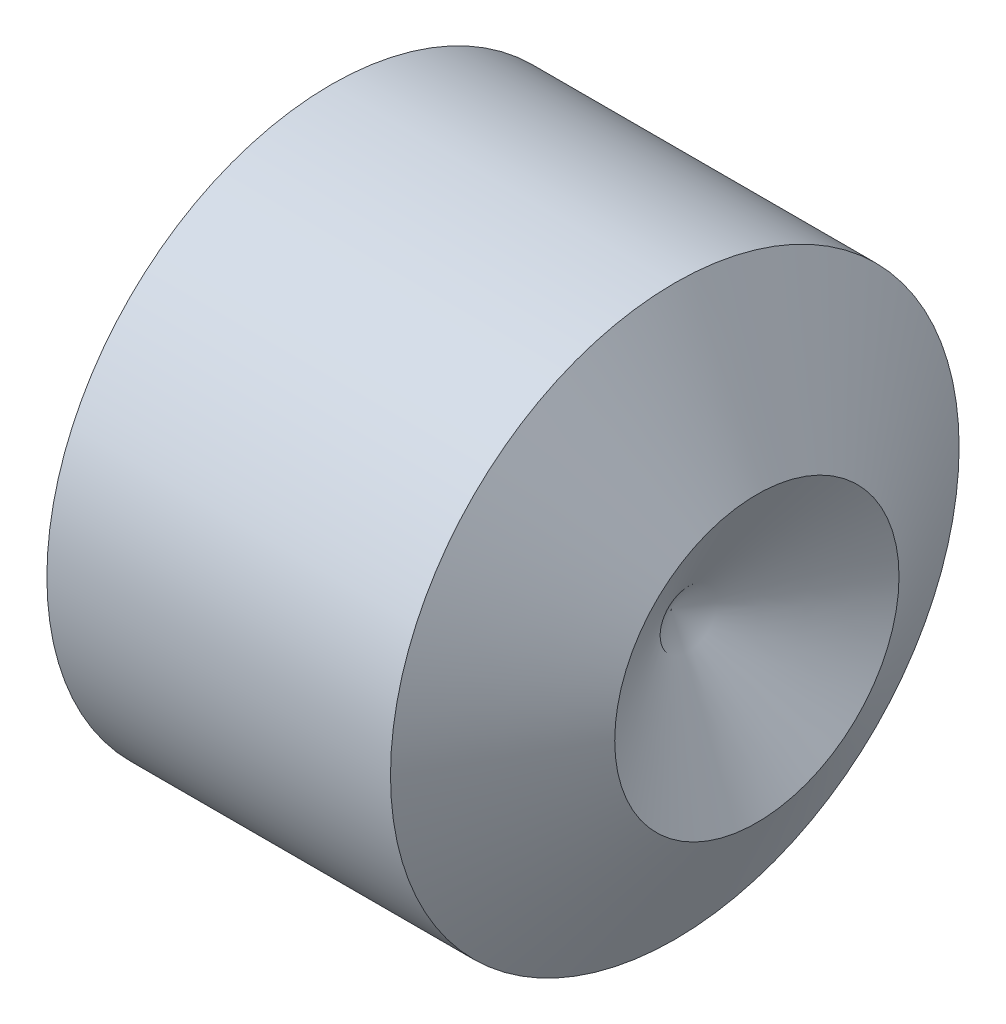
ISO-10303-21;
HEADER;
FILE_DESCRIPTION(('STEP AP214'),'2;1');
FILE_NAME('part.step','',(''),(''),'','','');
FILE_SCHEMA(('AUTOMOTIVE_DESIGN { 1 0 10303 214 1 1 1 1 }'));
ENDSEC;
DATA;
#1=APPLICATION_CONTEXT('core data for automotive mechanical design processes');
#2=APPLICATION_PROTOCOL_DEFINITION('international standard','automotive_design',2000,#1);
#3=PRODUCT_CONTEXT('',#1,'mechanical');
#4=PRODUCT('Part','Part','',(#3));
#5=PRODUCT_RELATED_PRODUCT_CATEGORY('part','',(#4));
#6=PRODUCT_DEFINITION_FORMATION('','',#4);
#7=PRODUCT_DEFINITION_CONTEXT('part definition',#1,'design');
#8=PRODUCT_DEFINITION('design','',#6,#7);
#9=PRODUCT_DEFINITION_SHAPE('','',#8);
#10=(LENGTH_UNIT() NAMED_UNIT(*) SI_UNIT(.MILLI.,.METRE.));
#11=(NAMED_UNIT(*) PLANE_ANGLE_UNIT() SI_UNIT($,.RADIAN.));
#12=(NAMED_UNIT(*) SI_UNIT($,.STERADIAN.) SOLID_ANGLE_UNIT());
#13=UNCERTAINTY_MEASURE_WITH_UNIT(LENGTH_MEASURE(1.E-05),#10,'distance_accuracy_value','');
#14=(GEOMETRIC_REPRESENTATION_CONTEXT(3) GLOBAL_UNCERTAINTY_ASSIGNED_CONTEXT((#13)) GLOBAL_UNIT_ASSIGNED_CONTEXT((#10,
#11,#12)) REPRESENTATION_CONTEXT('',''));
#15=CARTESIAN_POINT('',(0.,0.,0.));
#16=DIRECTION('',(0.,0.,1.));
#17=DIRECTION('',(1.,0.,0.));
#18=AXIS2_PLACEMENT_3D('',#15,#16,#17);
#19=CARTESIAN_POINT('',(-23.7448501262202,0.0231396517733629,4.59881748088264));
#20=DIRECTION('',(-1.,0.,0.));
#21=DIRECTION('',(0.,0.,1.));
#22=AXIS2_PLACEMENT_3D('',#19,#20,#21);
#23=PLANE('',#22);
#24=CARTESIAN_POINT('',(-23.7448501262202,0.0231396517733629,4.59881748088264));
#25=DIRECTION('',(-1.,0.,0.));
#26=DIRECTION('',(0.,0.,1.));
#27=AXIS2_PLACEMENT_3D('',#24,#25,#26);
#28=CIRCLE('',#27,2.055);
#29=CARTESIAN_POINT('',(-23.7448501262202,0.0231396517733629,6.65381748088265));
#30=VERTEX_POINT('',#29);
#31=EDGE_CURVE('E10',#30,#30,#28,.T.);
#32=ORIENTED_EDGE('',*,*,#31,.T.);
#33=EDGE_LOOP('',(#32));
#34=FACE_BOUND('',#33,.T.);
#35=DIRECTION('',(0.,0.,-1.));
#36=VECTOR('',#35,1.);
#37=CARTESIAN_POINT('',(-23.7448501262202,1.27313965177336,5.32050531736968));
#38=LINE('',#37,#36);
#39=CARTESIAN_POINT('',(-23.7448501262202,1.27313965177336,5.32050531736968));
#40=VERTEX_POINT('',#39);
#41=CARTESIAN_POINT('',(-23.7448501262202,1.27313965177336,3.87712964439561));
#42=VERTEX_POINT('',#41);
#43=EDGE_CURVE('E77',#40,#42,#38,.T.);
#44=ORIENTED_EDGE('',*,*,#43,.F.);
#45=DIRECTION('',(0.,-0.866025403784438,0.5));
#46=VECTOR('',#45,1.);
#47=CARTESIAN_POINT('',(-23.7448501262202,1.27313965177336,5.32050531736968));
#48=LINE('',#47,#46);
#49=CARTESIAN_POINT('',(-23.7448501262202,0.0231396517733635,6.04219315385671));
#50=VERTEX_POINT('',#49);
#51=EDGE_CURVE('E30',#40,#50,#48,.T.);
#52=ORIENTED_EDGE('',*,*,#51,.T.);
#53=DIRECTION('',(0.,0.866025403784439,0.5));
#54=VECTOR('',#53,1.);
#55=CARTESIAN_POINT('',(-23.7448501262202,-1.22686034822664,5.32050531736968));
#56=LINE('',#55,#54);
#57=CARTESIAN_POINT('',(-23.7448501262202,-1.22686034822664,5.32050531736968));
#58=VERTEX_POINT('',#57);
#59=EDGE_CURVE('E83',#58,#50,#56,.T.);
#60=ORIENTED_EDGE('',*,*,#59,.F.);
#61=DIRECTION('',(0.,0.,-1.));
#62=VECTOR('',#61,1.);
#63=CARTESIAN_POINT('',(-23.7448501262202,-1.22686034822664,5.32050531736968));
#64=LINE('',#63,#62);
#65=CARTESIAN_POINT('',(-23.7448501262202,-1.22686034822664,3.87712964439561));
#66=VERTEX_POINT('',#65);
#67=EDGE_CURVE('E103',#58,#66,#64,.T.);
#68=ORIENTED_EDGE('',*,*,#67,.T.);
#69=DIRECTION('',(0.,0.866025403784438,-0.500000000000001));
#70=VECTOR('',#69,1.);
#71=CARTESIAN_POINT('',(-23.7448501262202,-1.22686034822664,3.87712964439561));
#72=LINE('',#71,#70);
#73=CARTESIAN_POINT('',(-23.7448501262202,0.0231396517733629,3.15544180790858));
#74=VERTEX_POINT('',#73);
#75=EDGE_CURVE('E106',#66,#74,#72,.T.);
#76=ORIENTED_EDGE('',*,*,#75,.T.);
#77=DIRECTION('',(0.,-0.866025403784439,-0.5));
#78=VECTOR('',#77,1.);
#79=CARTESIAN_POINT('',(-23.7448501262202,1.27313965177336,3.87712964439561));
#80=LINE('',#79,#78);
#81=EDGE_CURVE('E109',#42,#74,#80,.T.);
#82=ORIENTED_EDGE('',*,*,#81,.F.);
#83=EDGE_LOOP('',(#44,#52,#60,#68,#76,#82));
#84=FACE_BOUND('',#83,.T.);
#85=ADVANCED_FACE('F16',(#34,#84),#23,.T.);
#86=CARTESIAN_POINT('',(-23.7448501262202,0.0231396517733629,4.59881748088264));
#87=DIRECTION('',(1.,0.,0.));
#88=DIRECTION('',(0.,0.,-1.));
#89=AXIS2_PLACEMENT_3D('',#86,#87,#88);
#90=CONICAL_SURFACE('',#89,2.055,1.0471975511966);
#91=CARTESIAN_POINT('',(-23.4879292564308,0.0231396517733629,4.59881748088264));
#92=DIRECTION('',(-1.,0.,0.));
#93=DIRECTION('',(0.,0.,1.));
#94=AXIS2_PLACEMENT_3D('',#91,#92,#93);
#95=CIRCLE('',#94,2.5);
#96=CARTESIAN_POINT('',(-23.4879292564308,0.0231396517733629,7.09881748088265));
#97=VERTEX_POINT('',#96);
#98=EDGE_CURVE('E23',#97,#97,#95,.T.);
#99=ORIENTED_EDGE('',*,*,#98,.T.);
#100=EDGE_LOOP('',(#99));
#101=FACE_BOUND('',#100,.T.);
#102=ORIENTED_EDGE('',*,*,#31,.F.);
#103=EDGE_LOOP('',(#102));
#104=FACE_BOUND('',#103,.T.);
#105=ADVANCED_FACE('F129',(#101,#104),#90,.T.);
#106=CARTESIAN_POINT('',(-36.4448501262202,0.0231396517733629,4.59881748088264));
#107=DIRECTION('',(-1.,0.,0.));
#108=DIRECTION('',(0.,0.,1.));
#109=AXIS2_PLACEMENT_3D('',#106,#107,#108);
#110=CYLINDRICAL_SURFACE('',#109,2.5);
#111=CARTESIAN_POINT('',(-20.4665379627072,0.0231396517733629,4.59881748088264));
#112=DIRECTION('',(-1.,0.,0.));
#113=DIRECTION('',(0.,0.,1.));
#114=AXIS2_PLACEMENT_3D('',#111,#112,#113);
#115=CIRCLE('',#114,2.5);
#116=CARTESIAN_POINT('',(-20.4665379627072,0.0231396517733629,7.09881748088265));
#117=VERTEX_POINT('',#116);
#118=EDGE_CURVE('E124',#117,#117,#115,.T.);
#119=ORIENTED_EDGE('',*,*,#118,.T.);
#120=EDGE_LOOP('',(#119));
#121=FACE_BOUND('',#120,.T.);
#122=ORIENTED_EDGE('',*,*,#98,.F.);
#123=EDGE_LOOP('',(#122));
#124=FACE_BOUND('',#123,.T.);
#125=ADVANCED_FACE('F132',(#121,#124),#110,.T.);
#126=CARTESIAN_POINT('',(-20.4665379627072,0.0231396517733629,4.59881748088264));
#127=DIRECTION('',(-1.,0.,0.));
#128=DIRECTION('',(0.,0.,1.));
#129=AXIS2_PLACEMENT_3D('',#126,#127,#128);
#130=CONICAL_SURFACE('',#129,2.5,1.0471975511966);
#131=CARTESIAN_POINT('',(-19.7448501262202,0.0231396517733629,4.59881748088264));
#132=DIRECTION('',(-1.,0.,0.));
#133=DIRECTION('',(0.,0.,1.));
#134=AXIS2_PLACEMENT_3D('',#131,#132,#133);
#135=CIRCLE('',#134,1.25);
#136=CARTESIAN_POINT('',(-19.7448501262202,0.0231396517733629,5.84881748088264));
#137=VERTEX_POINT('',#136);
#138=EDGE_CURVE('E84',#137,#137,#135,.T.);
#139=ORIENTED_EDGE('',*,*,#138,.T.);
#140=EDGE_LOOP('',(#139));
#141=FACE_BOUND('',#140,.T.);
#142=ORIENTED_EDGE('',*,*,#118,.F.);
#143=EDGE_LOOP('',(#142));
#144=FACE_BOUND('',#143,.T.);
#145=ADVANCED_FACE('F134',(#141,#144),#130,.T.);
#146=CARTESIAN_POINT('',(-20.4959259000046,0.0231396517733629,4.59881748088264));
#147=DIRECTION('',(1.,0.,0.));
#148=DIRECTION('',(0.,0.,-1.));
#149=AXIS2_PLACEMENT_3D('',#146,#147,#148);
#150=CONICAL_SURFACE('',#149,0.,1.02974425867666);
#151=ORIENTED_EDGE('',*,*,#138,.F.);
#152=EDGE_LOOP('',(#151));
#153=FACE_BOUND('',#152,.T.);
#154=CARTESIAN_POINT('',(-20.4959259000046,0.0231396517733629,4.59881748088264));
#155=VERTEX_POINT('',#154);
#156=VERTEX_LOOP('',#155);
#157=FACE_BOUND('',#156,.T.);
#158=ADVANCED_FACE('F142',(#153,#157),#150,.F.);
#159=CARTESIAN_POINT('',(-21.7448501262202,1.27313965177336,5.32050531736968));
#160=DIRECTION('',(0.,-0.5,-0.866025403784438));
#161=DIRECTION('',(0.,0.866025403784438,-0.5));
#162=AXIS2_PLACEMENT_3D('',#159,#160,#161);
#163=PLANE('',#162);
#164=ORIENTED_EDGE('',*,*,#51,.F.);
#165=DIRECTION('',(-1.,0.,0.));
#166=VECTOR('',#165,1.);
#167=CARTESIAN_POINT('',(-21.7448501262202,1.27313965177336,5.32050531736968));
#168=LINE('',#167,#166);
#169=CARTESIAN_POINT('',(-21.7448501262202,1.27313965177336,5.32050531736968));
#170=VERTEX_POINT('',#169);
#171=EDGE_CURVE('E71',#170,#40,#168,.T.);
#172=ORIENTED_EDGE('',*,*,#171,.F.);
#173=DIRECTION('',(0.,-0.866025403784438,0.5));
#174=VECTOR('',#173,1.);
#175=CARTESIAN_POINT('',(-21.7448501262202,1.27313965177336,5.32050531736968));
#176=LINE('',#175,#174);
#177=CARTESIAN_POINT('',(-21.7448501262202,0.0231396517733635,6.04219315385671));
#178=VERTEX_POINT('',#177);
#179=EDGE_CURVE('E66',#170,#178,#176,.T.);
#180=ORIENTED_EDGE('',*,*,#179,.T.);
#181=DIRECTION('',(-1.,0.,0.));
#182=VECTOR('',#181,1.);
#183=CARTESIAN_POINT('',(-21.7448501262202,0.0231396517733635,6.04219315385671));
#184=LINE('',#183,#182);
#185=EDGE_CURVE('E69',#178,#50,#184,.T.);
#186=ORIENTED_EDGE('',*,*,#185,.T.);
#187=EDGE_LOOP('',(#164,#172,#180,#186));
#188=FACE_BOUND('',#187,.T.);
#189=ADVANCED_FACE('F68',(#188),#163,.T.);
#190=CARTESIAN_POINT('',(-21.7448501262202,-1.22686034822664,5.32050531736968));
#191=DIRECTION('',(0.,-0.5,0.866025403784439));
#192=DIRECTION('',(0.,-0.866025403784439,-0.5));
#193=AXIS2_PLACEMENT_3D('',#190,#191,#192);
#194=PLANE('',#193);
#195=ORIENTED_EDGE('',*,*,#59,.T.);
#196=ORIENTED_EDGE('',*,*,#185,.F.);
#197=DIRECTION('',(0.,0.866025403784439,0.5));
#198=VECTOR('',#197,1.);
#199=CARTESIAN_POINT('',(-21.7448501262202,-1.22686034822664,5.32050531736968));
#200=LINE('',#199,#198);
#201=CARTESIAN_POINT('',(-21.7448501262202,-1.22686034822664,5.32050531736968));
#202=VERTEX_POINT('',#201);
#203=EDGE_CURVE('E76',#202,#178,#200,.T.);
#204=ORIENTED_EDGE('',*,*,#203,.F.);
#205=DIRECTION('',(-1.,0.,0.));
#206=VECTOR('',#205,1.);
#207=CARTESIAN_POINT('',(-21.7448501262202,-1.22686034822664,5.32050531736968));
#208=LINE('',#207,#206);
#209=EDGE_CURVE('E85',#202,#58,#208,.T.);
#210=ORIENTED_EDGE('',*,*,#209,.T.);
#211=EDGE_LOOP('',(#195,#196,#204,#210));
#212=FACE_BOUND('',#211,.T.);
#213=ADVANCED_FACE('F81',(#212),#194,.F.);
#214=CARTESIAN_POINT('',(-21.7448501262202,-1.22686034822664,5.32050531736968));
#215=DIRECTION('',(0.,1.,0.));
#216=DIRECTION('',(0.,0.,1.));
#217=AXIS2_PLACEMENT_3D('',#214,#215,#216);
#218=PLANE('',#217);
#219=ORIENTED_EDGE('',*,*,#67,.F.);
#220=ORIENTED_EDGE('',*,*,#209,.F.);
#221=DIRECTION('',(0.,0.,-1.));
#222=VECTOR('',#221,1.);
#223=CARTESIAN_POINT('',(-21.7448501262202,-1.22686034822664,5.32050531736968));
#224=LINE('',#223,#222);
#225=CARTESIAN_POINT('',(-21.7448501262202,-1.22686034822664,3.87712964439561));
#226=VERTEX_POINT('',#225);
#227=EDGE_CURVE('E90',#202,#226,#224,.T.);
#228=ORIENTED_EDGE('',*,*,#227,.T.);
#229=DIRECTION('',(-1.,0.,0.));
#230=VECTOR('',#229,1.);
#231=CARTESIAN_POINT('',(-21.7448501262202,-1.22686034822664,3.87712964439561));
#232=LINE('',#231,#230);
#233=EDGE_CURVE('E119',#226,#66,#232,.T.);
#234=ORIENTED_EDGE('',*,*,#233,.T.);
#235=EDGE_LOOP('',(#219,#220,#228,#234));
#236=FACE_BOUND('',#235,.T.);
#237=ADVANCED_FACE('F165',(#236),#218,.T.);
#238=CARTESIAN_POINT('',(-21.7448501262202,-1.22686034822664,3.87712964439561));
#239=DIRECTION('',(0.,0.500000000000001,0.866025403784438));
#240=DIRECTION('',(0.,-0.866025403784438,0.500000000000001));
#241=AXIS2_PLACEMENT_3D('',#238,#239,#240);
#242=PLANE('',#241);
#243=ORIENTED_EDGE('',*,*,#75,.F.);
#244=ORIENTED_EDGE('',*,*,#233,.F.);
#245=DIRECTION('',(0.,0.866025403784438,-0.500000000000001));
#246=VECTOR('',#245,1.);
#247=CARTESIAN_POINT('',(-21.7448501262202,-1.22686034822664,3.87712964439561));
#248=LINE('',#247,#246);
#249=CARTESIAN_POINT('',(-21.7448501262202,0.0231396517733629,3.15544180790858));
#250=VERTEX_POINT('',#249);
#251=EDGE_CURVE('E92',#226,#250,#248,.T.);
#252=ORIENTED_EDGE('',*,*,#251,.T.);
#253=DIRECTION('',(-1.,0.,0.));
#254=VECTOR('',#253,1.);
#255=CARTESIAN_POINT('',(-21.7448501262202,0.0231396517733629,3.15544180790858));
#256=LINE('',#255,#254);
#257=EDGE_CURVE('E117',#250,#74,#256,.T.);
#258=ORIENTED_EDGE('',*,*,#257,.T.);
#259=EDGE_LOOP('',(#243,#244,#252,#258));
#260=FACE_BOUND('',#259,.T.);
#261=ADVANCED_FACE('F161',(#260),#242,.T.);
#262=CARTESIAN_POINT('',(-21.7448501262202,1.27313965177336,3.87712964439561));
#263=DIRECTION('',(0.,0.5,-0.866025403784439));
#264=DIRECTION('',(0.,0.866025403784439,0.5));
#265=AXIS2_PLACEMENT_3D('',#262,#263,#264);
#266=PLANE('',#265);
#267=ORIENTED_EDGE('',*,*,#81,.T.);
#268=ORIENTED_EDGE('',*,*,#257,.F.);
#269=DIRECTION('',(0.,-0.866025403784439,-0.5));
#270=VECTOR('',#269,1.);
#271=CARTESIAN_POINT('',(-21.7448501262202,1.27313965177336,3.87712964439561));
#272=LINE('',#271,#270);
#273=CARTESIAN_POINT('',(-21.7448501262202,1.27313965177336,3.87712964439561));
#274=VERTEX_POINT('',#273);
#275=EDGE_CURVE('E96',#274,#250,#272,.T.);
#276=ORIENTED_EDGE('',*,*,#275,.F.);
#277=DIRECTION('',(-1.,0.,0.));
#278=VECTOR('',#277,1.);
#279=CARTESIAN_POINT('',(-21.7448501262202,1.27313965177336,3.87712964439561));
#280=LINE('',#279,#278);
#281=EDGE_CURVE('E115',#274,#42,#280,.T.);
#282=ORIENTED_EDGE('',*,*,#281,.T.);
#283=EDGE_LOOP('',(#267,#268,#276,#282));
#284=FACE_BOUND('',#283,.T.);
#285=ADVANCED_FACE('F158',(#284),#266,.F.);
#286=CARTESIAN_POINT('',(-21.7448501262202,1.27313965177336,5.32050531736968));
#287=DIRECTION('',(0.,1.,0.));
#288=DIRECTION('',(0.,0.,1.));
#289=AXIS2_PLACEMENT_3D('',#286,#287,#288);
#290=PLANE('',#289);
#291=ORIENTED_EDGE('',*,*,#43,.T.);
#292=ORIENTED_EDGE('',*,*,#281,.F.);
#293=DIRECTION('',(0.,0.,-1.));
#294=VECTOR('',#293,1.);
#295=CARTESIAN_POINT('',(-21.7448501262202,1.27313965177336,5.32050531736968));
#296=LINE('',#295,#294);
#297=EDGE_CURVE('E99',#170,#274,#296,.T.);
#298=ORIENTED_EDGE('',*,*,#297,.F.);
#299=ORIENTED_EDGE('',*,*,#171,.T.);
#300=EDGE_LOOP('',(#291,#292,#298,#299));
#301=FACE_BOUND('',#300,.T.);
#302=ADVANCED_FACE('F154',(#301),#290,.F.);
#303=CARTESIAN_POINT('',(-21.7448501262202,2.52313965177336,4.59881748088264));
#304=DIRECTION('',(1.,0.,0.));
#305=DIRECTION('',(0.,0.,-1.));
#306=AXIS2_PLACEMENT_3D('',#303,#304,#305);
#307=PLANE('',#306);
#308=ORIENTED_EDGE('',*,*,#179,.F.);
#309=ORIENTED_EDGE('',*,*,#297,.T.);
#310=ORIENTED_EDGE('',*,*,#275,.T.);
#311=ORIENTED_EDGE('',*,*,#251,.F.);
#312=ORIENTED_EDGE('',*,*,#227,.F.);
#313=ORIENTED_EDGE('',*,*,#203,.T.);
#314=EDGE_LOOP('',(#308,#309,#310,#311,#312,#313));
#315=FACE_BOUND('',#314,.T.);
#316=ADVANCED_FACE('F88',(#315),#307,.F.);
#317=CLOSED_SHELL('',(#85,#105,#125,#145,#158,#189,#213,#237,#261,#285,#302,#316));
#318=MANIFOLD_SOLID_BREP('B1',#317);
#319=ADVANCED_BREP_SHAPE_REPRESENTATION('',(#18,#318),#14);
#320=SHAPE_DEFINITION_REPRESENTATION(#9,#319);
ENDSEC;
END-ISO-10303-21;
